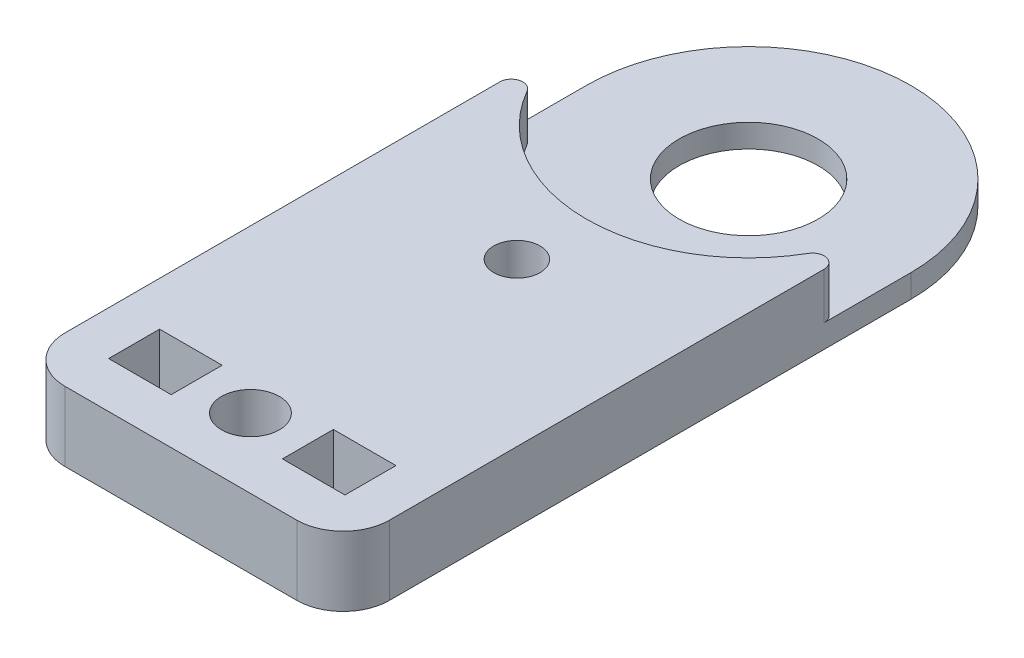
ISO-10303-21;
HEADER;
FILE_DESCRIPTION(('STEP AP214'),'2;1');
FILE_NAME('part.step','',(''),(''),'','','');
FILE_SCHEMA(('AUTOMOTIVE_DESIGN { 1 0 10303 214 1 1 1 1 }'));
ENDSEC;
DATA;
#1=APPLICATION_CONTEXT('core data for automotive mechanical design processes');
#2=APPLICATION_PROTOCOL_DEFINITION('international standard','automotive_design',2000,#1);
#3=PRODUCT_CONTEXT('',#1,'mechanical');
#4=PRODUCT('Part','Part','',(#3));
#5=PRODUCT_RELATED_PRODUCT_CATEGORY('part','',(#4));
#6=PRODUCT_DEFINITION_FORMATION('','',#4);
#7=PRODUCT_DEFINITION_CONTEXT('part definition',#1,'design');
#8=PRODUCT_DEFINITION('design','',#6,#7);
#9=PRODUCT_DEFINITION_SHAPE('','',#8);
#10=(LENGTH_UNIT() NAMED_UNIT(*) SI_UNIT(.MILLI.,.METRE.));
#11=(NAMED_UNIT(*) PLANE_ANGLE_UNIT() SI_UNIT($,.RADIAN.));
#12=(NAMED_UNIT(*) SI_UNIT($,.STERADIAN.) SOLID_ANGLE_UNIT());
#13=UNCERTAINTY_MEASURE_WITH_UNIT(LENGTH_MEASURE(1.E-05),#10,'distance_accuracy_value','');
#14=(GEOMETRIC_REPRESENTATION_CONTEXT(3) GLOBAL_UNCERTAINTY_ASSIGNED_CONTEXT((#13)) GLOBAL_UNIT_ASSIGNED_CONTEXT((#10,
#11,#12)) REPRESENTATION_CONTEXT('',''));
#15=CARTESIAN_POINT('',(0.,0.,0.));
#16=DIRECTION('',(0.,0.,1.));
#17=DIRECTION('',(1.,0.,0.));
#18=AXIS2_PLACEMENT_3D('',#15,#16,#17);
#19=CARTESIAN_POINT('',(0.,1.,-12.25));
#20=DIRECTION('',(0.,-1.,0.));
#21=DIRECTION('',(0.,0.,-1.));
#22=AXIS2_PLACEMENT_3D('',#19,#20,#21);
#23=CYLINDRICAL_SURFACE('',#22,7.);
#24=CARTESIAN_POINT('',(0.,1.,-12.25));
#25=DIRECTION('',(0.,1.,0.));
#26=DIRECTION('',(0.,0.,1.));
#27=AXIS2_PLACEMENT_3D('',#24,#25,#26);
#28=CIRCLE('',#27,7.);
#29=CARTESIAN_POINT('',(7.,1.,-12.25));
#30=VERTEX_POINT('',#29);
#31=CARTESIAN_POINT('',(-7.,1.,-12.25));
#32=VERTEX_POINT('',#31);
#33=EDGE_CURVE('E263',#30,#32,#28,.T.);
#34=ORIENTED_EDGE('',*,*,#33,.F.);
#35=DIRECTION('',(0.,-1.,0.));
#36=VECTOR('',#35,1.);
#37=CARTESIAN_POINT('',(7.,3.,-12.25));
#38=LINE('',#37,#36);
#39=CARTESIAN_POINT('',(7.,0.,-12.25));
#40=VERTEX_POINT('',#39);
#41=EDGE_CURVE('E252',#30,#40,#38,.T.);
#42=ORIENTED_EDGE('',*,*,#41,.T.);
#43=CARTESIAN_POINT('',(0.,0.,-12.25));
#44=DIRECTION('',(0.,1.,0.));
#45=DIRECTION('',(0.,0.,1.));
#46=AXIS2_PLACEMENT_3D('',#43,#44,#45);
#47=CIRCLE('',#46,7.);
#48=CARTESIAN_POINT('',(-7.,0.,-12.25));
#49=VERTEX_POINT('',#48);
#50=EDGE_CURVE('E262',#40,#49,#47,.T.);
#51=ORIENTED_EDGE('',*,*,#50,.T.);
#52=DIRECTION('',(0.,-1.,0.));
#53=VECTOR('',#52,1.);
#54=CARTESIAN_POINT('',(-7.,3.,-12.25));
#55=LINE('',#54,#53);
#56=EDGE_CURVE('E205',#32,#49,#55,.T.);
#57=ORIENTED_EDGE('',*,*,#56,.F.);
#58=EDGE_LOOP('',(#34,#42,#51,#57));
#59=FACE_BOUND('',#58,.T.);
#60=ADVANCED_FACE('F37',(#59),#23,.T.);
#61=CARTESIAN_POINT('',(0.,1.,-12.25));
#62=DIRECTION('',(0.,-1.,0.));
#63=DIRECTION('',(0.,0.,-1.));
#64=AXIS2_PLACEMENT_3D('',#61,#62,#63);
#65=CYLINDRICAL_SURFACE('',#64,3.);
#66=CARTESIAN_POINT('',(0.,1.,-12.25));
#67=DIRECTION('',(0.,1.,0.));
#68=DIRECTION('',(0.,0.,1.));
#69=AXIS2_PLACEMENT_3D('',#66,#67,#68);
#70=CIRCLE('',#69,3.);
#71=CARTESIAN_POINT('',(0.,1.,-9.25));
#72=VERTEX_POINT('',#71);
#73=EDGE_CURVE('E266',#72,#72,#70,.T.);
#74=ORIENTED_EDGE('',*,*,#73,.T.);
#75=EDGE_LOOP('',(#74));
#76=FACE_BOUND('',#75,.T.);
#77=CARTESIAN_POINT('',(0.,0.,-12.25));
#78=DIRECTION('',(0.,1.,0.));
#79=DIRECTION('',(0.,0.,1.));
#80=AXIS2_PLACEMENT_3D('',#77,#78,#79);
#81=CIRCLE('',#80,3.);
#82=CARTESIAN_POINT('',(0.,0.,-9.25));
#83=VERTEX_POINT('',#82);
#84=EDGE_CURVE('E267',#83,#83,#81,.T.);
#85=ORIENTED_EDGE('',*,*,#84,.F.);
#86=EDGE_LOOP('',(#85));
#87=FACE_BOUND('',#86,.T.);
#88=ADVANCED_FACE('F406',(#76,#87),#65,.F.);
#89=CARTESIAN_POINT('',(0.,1.,0.));
#90=DIRECTION('',(0.,1.,0.));
#91=DIRECTION('',(0.,0.,1.));
#92=AXIS2_PLACEMENT_3D('',#89,#90,#91);
#93=PLANE('',#92);
#94=ORIENTED_EDGE('',*,*,#33,.T.);
#95=DIRECTION('',(0.,0.,-1.));
#96=VECTOR('',#95,1.);
#97=CARTESIAN_POINT('',(-7.,1.,0.));
#98=LINE('',#97,#96);
#99=CARTESIAN_POINT('',(-7.,1.,-8.50834261322606));
#100=VERTEX_POINT('',#99);
#101=EDGE_CURVE('E290',#100,#32,#98,.T.);
#102=ORIENTED_EDGE('',*,*,#101,.F.);
#103=CARTESIAN_POINT('',(-6.5,1.,-8.50834261322606));
#104=DIRECTION('',(0.,1.,0.));
#105=DIRECTION('',(0.,0.,1.));
#106=AXIS2_PLACEMENT_3D('',#103,#104,#105);
#107=CIRCLE('',#106,0.5);
#108=CARTESIAN_POINT('',(-6.06666666666667,1.,-8.75778643901099));
#109=VERTEX_POINT('',#108);
#110=EDGE_CURVE('E297',#100,#109,#107,.F.);
#111=ORIENTED_EDGE('',*,*,#110,.T.);
#112=CARTESIAN_POINT('',(0.,1.,-12.25));
#113=DIRECTION('',(0.,1.,0.));
#114=DIRECTION('',(0.,0.,1.));
#115=AXIS2_PLACEMENT_3D('',#112,#113,#114);
#116=CIRCLE('',#115,7.);
#117=CARTESIAN_POINT('',(6.06666666666667,1.,-8.75778643901099));
#118=VERTEX_POINT('',#117);
#119=EDGE_CURVE('E248',#118,#109,#116,.F.);
#120=ORIENTED_EDGE('',*,*,#119,.F.);
#121=CARTESIAN_POINT('',(6.5,1.,-8.50834261322606));
#122=DIRECTION('',(0.,1.,0.));
#123=DIRECTION('',(0.,0.,1.));
#124=AXIS2_PLACEMENT_3D('',#121,#122,#123);
#125=CIRCLE('',#124,0.5);
#126=CARTESIAN_POINT('',(7.,1.,-8.50834261322606));
#127=VERTEX_POINT('',#126);
#128=EDGE_CURVE('E295',#118,#127,#125,.F.);
#129=ORIENTED_EDGE('',*,*,#128,.T.);
#130=DIRECTION('',(0.,0.,1.));
#131=VECTOR('',#130,1.);
#132=CARTESIAN_POINT('',(7.,1.,0.));
#133=LINE('',#132,#131);
#134=EDGE_CURVE('E282',#30,#127,#133,.T.);
#135=ORIENTED_EDGE('',*,*,#134,.F.);
#136=EDGE_LOOP('',(#94,#102,#111,#120,#129,#135));
#137=FACE_BOUND('',#136,.T.);
#138=ORIENTED_EDGE('',*,*,#73,.F.);
#139=EDGE_LOOP('',(#138));
#140=FACE_BOUND('',#139,.T.);
#141=ADVANCED_FACE('F341',(#137,#140),#93,.T.);
#142=CARTESIAN_POINT('',(0.,0.,0.));
#143=DIRECTION('',(0.,1.,0.));
#144=DIRECTION('',(0.,0.,1.));
#145=AXIS2_PLACEMENT_3D('',#142,#143,#144);
#146=PLANE('',#145);
#147=DIRECTION('',(0.,0.,-1.));
#148=VECTOR('',#147,1.);
#149=CARTESIAN_POINT('',(7.,0.,0.));
#150=LINE('',#149,#148);
#151=CARTESIAN_POINT('',(7.,0.,10.25));
#152=VERTEX_POINT('',#151);
#153=EDGE_CURVE('E212',#152,#40,#150,.T.);
#154=ORIENTED_EDGE('',*,*,#153,.F.);
#155=CARTESIAN_POINT('',(5.,0.,10.25));
#156=DIRECTION('',(0.,1.,0.));
#157=DIRECTION('',(0.,0.,1.));
#158=AXIS2_PLACEMENT_3D('',#155,#156,#157);
#159=CIRCLE('',#158,2.);
#160=CARTESIAN_POINT('',(5.,0.,12.25));
#161=VERTEX_POINT('',#160);
#162=EDGE_CURVE('E304',#152,#161,#159,.F.);
#163=ORIENTED_EDGE('',*,*,#162,.T.);
#164=DIRECTION('',(1.,0.,0.));
#165=VECTOR('',#164,1.);
#166=CARTESIAN_POINT('',(0.,0.,12.25));
#167=LINE('',#166,#165);
#168=CARTESIAN_POINT('',(-4.99999999999999,0.,12.25));
#169=VERTEX_POINT('',#168);
#170=EDGE_CURVE('E216',#169,#161,#167,.T.);
#171=ORIENTED_EDGE('',*,*,#170,.F.);
#172=CARTESIAN_POINT('',(-4.99999999999999,0.,10.25));
#173=DIRECTION('',(0.,1.,0.));
#174=DIRECTION('',(0.,0.,1.));
#175=AXIS2_PLACEMENT_3D('',#172,#173,#174);
#176=CIRCLE('',#175,2.);
#177=CARTESIAN_POINT('',(-6.99999999999999,0.,10.25));
#178=VERTEX_POINT('',#177);
#179=EDGE_CURVE('E302',#169,#178,#176,.F.);
#180=ORIENTED_EDGE('',*,*,#179,.T.);
#181=DIRECTION('',(0.,0.,-1.));
#182=VECTOR('',#181,1.);
#183=CARTESIAN_POINT('',(-7.,0.,0.));
#184=LINE('',#183,#182);
#185=EDGE_CURVE('E214',#178,#49,#184,.T.);
#186=ORIENTED_EDGE('',*,*,#185,.T.);
#187=ORIENTED_EDGE('',*,*,#50,.F.);
#188=EDGE_LOOP('',(#154,#163,#171,#180,#186,#187));
#189=FACE_BOUND('',#188,.T.);
#190=ORIENTED_EDGE('',*,*,#84,.T.);
#191=EDGE_LOOP('',(#190));
#192=FACE_BOUND('',#191,.T.);
#193=CARTESIAN_POINT('',(0.,0.,-2.25));
#194=DIRECTION('',(0.,1.,0.));
#195=DIRECTION('',(0.,0.,1.));
#196=AXIS2_PLACEMENT_3D('',#193,#194,#195);
#197=CIRCLE('',#196,1.);
#198=CARTESIAN_POINT('',(0.,0.,-1.25));
#199=VERTEX_POINT('',#198);
#200=EDGE_CURVE('E206',#199,#199,#197,.T.);
#201=ORIENTED_EDGE('',*,*,#200,.T.);
#202=EDGE_LOOP('',(#201));
#203=FACE_BOUND('',#202,.T.);
#204=CARTESIAN_POINT('',(0.,0.,9.25));
#205=DIRECTION('',(0.,1.,0.));
#206=DIRECTION('',(0.,0.,1.));
#207=AXIS2_PLACEMENT_3D('',#204,#205,#206);
#208=CIRCLE('',#207,1.25);
#209=CARTESIAN_POINT('',(0.,0.,10.5));
#210=VERTEX_POINT('',#209);
#211=EDGE_CURVE('E209',#210,#210,#208,.T.);
#212=ORIENTED_EDGE('',*,*,#211,.T.);
#213=EDGE_LOOP('',(#212));
#214=FACE_BOUND('',#213,.T.);
#215=DIRECTION('',(0.,0.,1.));
#216=VECTOR('',#215,1.);
#217=CARTESIAN_POINT('',(-5.1,0.,0.));
#218=LINE('',#217,#216);
#219=CARTESIAN_POINT('',(-5.1,0.,8.07071615635404));
#220=VERTEX_POINT('',#219);
#221=CARTESIAN_POINT('',(-5.1,0.,10.270716156354));
#222=VERTEX_POINT('',#221);
#223=EDGE_CURVE('E168',#220,#222,#218,.T.);
#224=ORIENTED_EDGE('',*,*,#223,.T.);
#225=DIRECTION('',(-1.,0.,0.));
#226=VECTOR('',#225,1.);
#227=CARTESIAN_POINT('',(0.,0.,10.270716156354));
#228=LINE('',#227,#226);
#229=CARTESIAN_POINT('',(-2.4,0.,10.270716156354));
#230=VERTEX_POINT('',#229);
#231=EDGE_CURVE('E224',#230,#222,#228,.T.);
#232=ORIENTED_EDGE('',*,*,#231,.F.);
#233=DIRECTION('',(0.,0.,1.));
#234=VECTOR('',#233,1.);
#235=CARTESIAN_POINT('',(-2.4,0.,0.));
#236=LINE('',#235,#234);
#237=CARTESIAN_POINT('',(-2.4,0.,8.07071615635404));
#238=VERTEX_POINT('',#237);
#239=EDGE_CURVE('E221',#238,#230,#236,.T.);
#240=ORIENTED_EDGE('',*,*,#239,.F.);
#241=DIRECTION('',(-1.,0.,0.));
#242=VECTOR('',#241,1.);
#243=CARTESIAN_POINT('',(0.,0.,8.07071615635404));
#244=LINE('',#243,#242);
#245=EDGE_CURVE('E219',#238,#220,#244,.T.);
#246=ORIENTED_EDGE('',*,*,#245,.T.);
#247=EDGE_LOOP('',(#224,#232,#240,#246));
#248=FACE_BOUND('',#247,.T.);
#249=DIRECTION('',(0.,0.,1.));
#250=VECTOR('',#249,1.);
#251=CARTESIAN_POINT('',(2.40000000000001,0.,0.));
#252=LINE('',#251,#250);
#253=CARTESIAN_POINT('',(2.40000000000001,0.,8.07071615635404));
#254=VERTEX_POINT('',#253);
#255=CARTESIAN_POINT('',(2.40000000000001,0.,10.270716156354));
#256=VERTEX_POINT('',#255);
#257=EDGE_CURVE('E227',#254,#256,#252,.T.);
#258=ORIENTED_EDGE('',*,*,#257,.T.);
#259=DIRECTION('',(1.,0.,0.));
#260=VECTOR('',#259,1.);
#261=CARTESIAN_POINT('',(0.,0.,10.270716156354));
#262=LINE('',#261,#260);
#263=CARTESIAN_POINT('',(5.10000000000001,0.,10.270716156354));
#264=VERTEX_POINT('',#263);
#265=EDGE_CURVE('E236',#256,#264,#262,.T.);
#266=ORIENTED_EDGE('',*,*,#265,.T.);
#267=DIRECTION('',(0.,0.,1.));
#268=VECTOR('',#267,1.);
#269=CARTESIAN_POINT('',(5.10000000000001,0.,0.));
#270=LINE('',#269,#268);
#271=CARTESIAN_POINT('',(5.10000000000001,0.,8.07071615635404));
#272=VERTEX_POINT('',#271);
#273=EDGE_CURVE('E233',#272,#264,#270,.T.);
#274=ORIENTED_EDGE('',*,*,#273,.F.);
#275=DIRECTION('',(1.,0.,0.));
#276=VECTOR('',#275,1.);
#277=CARTESIAN_POINT('',(0.,0.,8.07071615635404));
#278=LINE('',#277,#276);
#279=EDGE_CURVE('E230',#254,#272,#278,.T.);
#280=ORIENTED_EDGE('',*,*,#279,.F.);
#281=EDGE_LOOP('',(#258,#266,#274,#280));
#282=FACE_BOUND('',#281,.T.);
#283=ADVANCED_FACE('F328',(#189,#192,#203,#214,#248,#282),#146,.F.);
#284=CARTESIAN_POINT('',(2.40000000000001,3.,0.));
#285=DIRECTION('',(1.,0.,0.));
#286=DIRECTION('',(0.,0.,-1.));
#287=AXIS2_PLACEMENT_3D('',#284,#285,#286);
#288=PLANE('',#287);
#289=ORIENTED_EDGE('',*,*,#257,.F.);
#290=DIRECTION('',(0.,-1.,0.));
#291=VECTOR('',#290,1.);
#292=CARTESIAN_POINT('',(2.40000000000001,3.,8.07071615635404));
#293=LINE('',#292,#291);
#294=CARTESIAN_POINT('',(2.40000000000001,3.,8.07071615635404));
#295=VERTEX_POINT('',#294);
#296=EDGE_CURVE('E246',#295,#254,#293,.T.);
#297=ORIENTED_EDGE('',*,*,#296,.F.);
#298=DIRECTION('',(0.,0.,1.));
#299=VECTOR('',#298,1.);
#300=CARTESIAN_POINT('',(2.40000000000001,3.,0.));
#301=LINE('',#300,#299);
#302=CARTESIAN_POINT('',(2.40000000000001,3.,10.270716156354));
#303=VERTEX_POINT('',#302);
#304=EDGE_CURVE('E194',#295,#303,#301,.T.);
#305=ORIENTED_EDGE('',*,*,#304,.T.);
#306=DIRECTION('',(0.,-1.,0.));
#307=VECTOR('',#306,1.);
#308=CARTESIAN_POINT('',(2.40000000000001,3.,10.270716156354));
#309=LINE('',#308,#307);
#310=EDGE_CURVE('E173',#303,#256,#309,.T.);
#311=ORIENTED_EDGE('',*,*,#310,.T.);
#312=EDGE_LOOP('',(#289,#297,#305,#311));
#313=FACE_BOUND('',#312,.T.);
#314=ADVANCED_FACE('F380',(#313),#288,.T.);
#315=CARTESIAN_POINT('',(0.,3.,8.07071615635404));
#316=DIRECTION('',(0.,0.,-1.));
#317=DIRECTION('',(-1.,0.,0.));
#318=AXIS2_PLACEMENT_3D('',#315,#316,#317);
#319=PLANE('',#318);
#320=ORIENTED_EDGE('',*,*,#279,.T.);
#321=DIRECTION('',(0.,-1.,0.));
#322=VECTOR('',#321,1.);
#323=CARTESIAN_POINT('',(5.10000000000001,3.,8.07071615635404));
#324=LINE('',#323,#322);
#325=CARTESIAN_POINT('',(5.10000000000001,3.,8.07071615635404));
#326=VERTEX_POINT('',#325);
#327=EDGE_CURVE('E243',#326,#272,#324,.T.);
#328=ORIENTED_EDGE('',*,*,#327,.F.);
#329=DIRECTION('',(1.,0.,0.));
#330=VECTOR('',#329,1.);
#331=CARTESIAN_POINT('',(0.,3.,8.07071615635404));
#332=LINE('',#331,#330);
#333=EDGE_CURVE('E197',#295,#326,#332,.T.);
#334=ORIENTED_EDGE('',*,*,#333,.F.);
#335=ORIENTED_EDGE('',*,*,#296,.T.);
#336=EDGE_LOOP('',(#320,#328,#334,#335));
#337=FACE_BOUND('',#336,.T.);
#338=ADVANCED_FACE('F395',(#337),#319,.F.);
#339=CARTESIAN_POINT('',(5.10000000000001,3.,0.));
#340=DIRECTION('',(1.,0.,0.));
#341=DIRECTION('',(0.,0.,-1.));
#342=AXIS2_PLACEMENT_3D('',#339,#340,#341);
#343=PLANE('',#342);
#344=ORIENTED_EDGE('',*,*,#273,.T.);
#345=DIRECTION('',(0.,-1.,0.));
#346=VECTOR('',#345,1.);
#347=CARTESIAN_POINT('',(5.10000000000001,3.,10.270716156354));
#348=LINE('',#347,#346);
#349=CARTESIAN_POINT('',(5.10000000000001,3.,10.270716156354));
#350=VERTEX_POINT('',#349);
#351=EDGE_CURVE('E241',#350,#264,#348,.T.);
#352=ORIENTED_EDGE('',*,*,#351,.F.);
#353=DIRECTION('',(0.,0.,1.));
#354=VECTOR('',#353,1.);
#355=CARTESIAN_POINT('',(5.10000000000001,3.,0.));
#356=LINE('',#355,#354);
#357=EDGE_CURVE('E200',#326,#350,#356,.T.);
#358=ORIENTED_EDGE('',*,*,#357,.F.);
#359=ORIENTED_EDGE('',*,*,#327,.T.);
#360=EDGE_LOOP('',(#344,#352,#358,#359));
#361=FACE_BOUND('',#360,.T.);
#362=ADVANCED_FACE('F391',(#361),#343,.F.);
#363=CARTESIAN_POINT('',(-5.1,3.,0.));
#364=DIRECTION('',(1.,0.,0.));
#365=DIRECTION('',(0.,0.,-1.));
#366=AXIS2_PLACEMENT_3D('',#363,#364,#365);
#367=PLANE('',#366);
#368=ORIENTED_EDGE('',*,*,#223,.F.);
#369=DIRECTION('',(0.,-1.,0.));
#370=VECTOR('',#369,1.);
#371=CARTESIAN_POINT('',(-5.1,3.,8.07071615635404));
#372=LINE('',#371,#370);
#373=CARTESIAN_POINT('',(-5.1,3.,8.07071615635404));
#374=VERTEX_POINT('',#373);
#375=EDGE_CURVE('E163',#374,#220,#372,.T.);
#376=ORIENTED_EDGE('',*,*,#375,.F.);
#377=DIRECTION('',(0.,0.,1.));
#378=VECTOR('',#377,1.);
#379=CARTESIAN_POINT('',(-5.1,3.,0.));
#380=LINE('',#379,#378);
#381=CARTESIAN_POINT('',(-5.1,3.,10.270716156354));
#382=VERTEX_POINT('',#381);
#383=EDGE_CURVE('E166',#374,#382,#380,.T.);
#384=ORIENTED_EDGE('',*,*,#383,.T.);
#385=DIRECTION('',(0.,-1.,0.));
#386=VECTOR('',#385,1.);
#387=CARTESIAN_POINT('',(-5.1,3.,10.270716156354));
#388=LINE('',#387,#386);
#389=EDGE_CURVE('E249',#382,#222,#388,.T.);
#390=ORIENTED_EDGE('',*,*,#389,.T.);
#391=EDGE_LOOP('',(#368,#376,#384,#390));
#392=FACE_BOUND('',#391,.T.);
#393=ADVANCED_FACE('F165',(#392),#367,.T.);
#394=CARTESIAN_POINT('',(0.,3.,8.07071615635404));
#395=DIRECTION('',(0.,0.,1.));
#396=DIRECTION('',(1.,0.,0.));
#397=AXIS2_PLACEMENT_3D('',#394,#395,#396);
#398=PLANE('',#397);
#399=ORIENTED_EDGE('',*,*,#245,.F.);
#400=DIRECTION('',(0.,-1.,0.));
#401=VECTOR('',#400,1.);
#402=CARTESIAN_POINT('',(-2.4,3.,8.07071615635404));
#403=LINE('',#402,#401);
#404=CARTESIAN_POINT('',(-2.4,3.,8.07071615635404));
#405=VERTEX_POINT('',#404);
#406=EDGE_CURVE('E174',#405,#238,#403,.T.);
#407=ORIENTED_EDGE('',*,*,#406,.F.);
#408=DIRECTION('',(-1.,0.,0.));
#409=VECTOR('',#408,1.);
#410=CARTESIAN_POINT('',(0.,3.,8.07071615635404));
#411=LINE('',#410,#409);
#412=EDGE_CURVE('E181',#405,#374,#411,.T.);
#413=ORIENTED_EDGE('',*,*,#412,.T.);
#414=ORIENTED_EDGE('',*,*,#375,.T.);
#415=EDGE_LOOP('',(#399,#407,#413,#414));
#416=FACE_BOUND('',#415,.T.);
#417=ADVANCED_FACE('F186',(#416),#398,.T.);
#418=CARTESIAN_POINT('',(-2.4,3.,0.));
#419=DIRECTION('',(1.,0.,0.));
#420=DIRECTION('',(0.,0.,-1.));
#421=AXIS2_PLACEMENT_3D('',#418,#419,#420);
#422=PLANE('',#421);
#423=ORIENTED_EDGE('',*,*,#239,.T.);
#424=DIRECTION('',(0.,-1.,0.));
#425=VECTOR('',#424,1.);
#426=CARTESIAN_POINT('',(-2.4,3.,10.270716156354));
#427=LINE('',#426,#425);
#428=CARTESIAN_POINT('',(-2.4,3.,10.270716156354));
#429=VERTEX_POINT('',#428);
#430=EDGE_CURVE('E251',#429,#230,#427,.T.);
#431=ORIENTED_EDGE('',*,*,#430,.F.);
#432=DIRECTION('',(0.,0.,1.));
#433=VECTOR('',#432,1.);
#434=CARTESIAN_POINT('',(-2.4,3.,0.));
#435=LINE('',#434,#433);
#436=EDGE_CURVE('E188',#405,#429,#435,.T.);
#437=ORIENTED_EDGE('',*,*,#436,.F.);
#438=ORIENTED_EDGE('',*,*,#406,.T.);
#439=EDGE_LOOP('',(#423,#431,#437,#438));
#440=FACE_BOUND('',#439,.T.);
#441=ADVANCED_FACE('F457',(#440),#422,.F.);
#442=CARTESIAN_POINT('',(7.,3.,0.));
#443=DIRECTION('',(-1.,0.,0.));
#444=DIRECTION('',(0.,0.,1.));
#445=AXIS2_PLACEMENT_3D('',#442,#443,#444);
#446=PLANE('',#445);
#447=DIRECTION('',(0.,0.,-1.));
#448=VECTOR('',#447,1.);
#449=CARTESIAN_POINT('',(7.,3.,0.));
#450=LINE('',#449,#448);
#451=CARTESIAN_POINT('',(7.,3.,10.25));
#452=VERTEX_POINT('',#451);
#453=CARTESIAN_POINT('',(7.,3.,-8.50834261322606));
#454=VERTEX_POINT('',#453);
#455=EDGE_CURVE('E314',#452,#454,#450,.T.);
#456=ORIENTED_EDGE('',*,*,#455,.F.);
#457=DIRECTION('',(0.,-1.,0.));
#458=VECTOR('',#457,1.);
#459=CARTESIAN_POINT('',(7.,3.,10.25));
#460=LINE('',#459,#458);
#461=EDGE_CURVE('E299',#452,#152,#460,.T.);
#462=ORIENTED_EDGE('',*,*,#461,.T.);
#463=ORIENTED_EDGE('',*,*,#153,.T.);
#464=ORIENTED_EDGE('',*,*,#41,.F.);
#465=ORIENTED_EDGE('',*,*,#134,.T.);
#466=DIRECTION('',(0.,1.,0.));
#467=VECTOR('',#466,1.);
#468=CARTESIAN_POINT('',(7.,3.,-8.50834261322606));
#469=LINE('',#468,#467);
#470=EDGE_CURVE('E279',#127,#454,#469,.T.);
#471=ORIENTED_EDGE('',*,*,#470,.T.);
#472=EDGE_LOOP('',(#456,#462,#463,#464,#465,#471));
#473=FACE_BOUND('',#472,.T.);
#474=ADVANCED_FACE('F318',(#473),#446,.F.);
#475=CARTESIAN_POINT('',(0.,3.,-12.25));
#476=DIRECTION('',(0.,-1.,0.));
#477=DIRECTION('',(0.,0.,-1.));
#478=AXIS2_PLACEMENT_3D('',#475,#476,#477);
#479=CYLINDRICAL_SURFACE('',#478,7.);
#480=CARTESIAN_POINT('',(0.,3.,-12.25));
#481=DIRECTION('',(0.,1.,0.));
#482=DIRECTION('',(0.,0.,1.));
#483=AXIS2_PLACEMENT_3D('',#480,#481,#482);
#484=CIRCLE('',#483,7.);
#485=CARTESIAN_POINT('',(-6.06666666666667,3.,-8.75778643901099));
#486=VERTEX_POINT('',#485);
#487=CARTESIAN_POINT('',(6.06666666666667,3.,-8.75778643901099));
#488=VERTEX_POINT('',#487);
#489=EDGE_CURVE('E322',#486,#488,#484,.T.);
#490=ORIENTED_EDGE('',*,*,#489,.T.);
#491=DIRECTION('',(0.,-1.,0.));
#492=VECTOR('',#491,1.);
#493=CARTESIAN_POINT('',(6.06666666666667,3.,-8.75778643901099));
#494=LINE('',#493,#492);
#495=EDGE_CURVE('E276',#488,#118,#494,.T.);
#496=ORIENTED_EDGE('',*,*,#495,.T.);
#497=ORIENTED_EDGE('',*,*,#119,.T.);
#498=DIRECTION('',(0.,-1.,0.));
#499=VECTOR('',#498,1.);
#500=CARTESIAN_POINT('',(-6.06666666666667,3.,-8.75778643901099));
#501=LINE('',#500,#499);
#502=EDGE_CURVE('E270',#109,#486,#501,.F.);
#503=ORIENTED_EDGE('',*,*,#502,.T.);
#504=EDGE_LOOP('',(#490,#496,#497,#503));
#505=FACE_BOUND('',#504,.T.);
#506=ADVANCED_FACE('F352',(#505),#479,.F.);
#507=CARTESIAN_POINT('',(-7.,3.,0.));
#508=DIRECTION('',(-1.,0.,0.));
#509=DIRECTION('',(0.,0.,1.));
#510=AXIS2_PLACEMENT_3D('',#507,#508,#509);
#511=PLANE('',#510);
#512=ORIENTED_EDGE('',*,*,#185,.F.);
#513=DIRECTION('',(0.,-1.,0.));
#514=VECTOR('',#513,1.);
#515=CARTESIAN_POINT('',(-6.99999999999999,3.,10.25));
#516=LINE('',#515,#514);
#517=CARTESIAN_POINT('',(-6.99999999999999,3.,10.25));
#518=VERTEX_POINT('',#517);
#519=EDGE_CURVE('E11',#178,#518,#516,.F.);
#520=ORIENTED_EDGE('',*,*,#519,.T.);
#521=DIRECTION('',(0.,0.,-1.));
#522=VECTOR('',#521,1.);
#523=CARTESIAN_POINT('',(-7.,3.,0.));
#524=LINE('',#523,#522);
#525=CARTESIAN_POINT('',(-7.,3.,-8.50834261322606));
#526=VERTEX_POINT('',#525);
#527=EDGE_CURVE('E354',#518,#526,#524,.T.);
#528=ORIENTED_EDGE('',*,*,#527,.T.);
#529=DIRECTION('',(0.,-1.,0.));
#530=VECTOR('',#529,1.);
#531=CARTESIAN_POINT('',(-7.,3.,-8.50834261322606));
#532=LINE('',#531,#530);
#533=EDGE_CURVE('E292',#526,#100,#532,.T.);
#534=ORIENTED_EDGE('',*,*,#533,.T.);
#535=ORIENTED_EDGE('',*,*,#101,.T.);
#536=ORIENTED_EDGE('',*,*,#56,.T.);
#537=EDGE_LOOP('',(#512,#520,#528,#534,#535,#536));
#538=FACE_BOUND('',#537,.T.);
#539=ADVANCED_FACE('F335',(#538),#511,.T.);
#540=CARTESIAN_POINT('',(0.,3.,10.270716156354));
#541=DIRECTION('',(0.,0.,1.));
#542=DIRECTION('',(1.,0.,0.));
#543=AXIS2_PLACEMENT_3D('',#540,#541,#542);
#544=PLANE('',#543);
#545=ORIENTED_EDGE('',*,*,#231,.T.);
#546=ORIENTED_EDGE('',*,*,#389,.F.);
#547=DIRECTION('',(-1.,0.,0.));
#548=VECTOR('',#547,1.);
#549=CARTESIAN_POINT('',(0.,3.,10.270716156354));
#550=LINE('',#549,#548);
#551=EDGE_CURVE('E182',#429,#382,#550,.T.);
#552=ORIENTED_EDGE('',*,*,#551,.F.);
#553=ORIENTED_EDGE('',*,*,#430,.T.);
#554=EDGE_LOOP('',(#545,#546,#552,#553));
#555=FACE_BOUND('',#554,.T.);
#556=ADVANCED_FACE('F443',(#555),#544,.F.);
#557=CARTESIAN_POINT('',(0.,3.,12.25));
#558=DIRECTION('',(0.,0.,-1.));
#559=DIRECTION('',(-1.,0.,0.));
#560=AXIS2_PLACEMENT_3D('',#557,#558,#559);
#561=PLANE('',#560);
#562=ORIENTED_EDGE('',*,*,#170,.T.);
#563=DIRECTION('',(0.,-1.,0.));
#564=VECTOR('',#563,1.);
#565=CARTESIAN_POINT('',(5.,3.,12.25));
#566=LINE('',#565,#564);
#567=CARTESIAN_POINT('',(5.,3.,12.25));
#568=VERTEX_POINT('',#567);
#569=EDGE_CURVE('E58',#161,#568,#566,.F.);
#570=ORIENTED_EDGE('',*,*,#569,.T.);
#571=DIRECTION('',(1.,0.,0.));
#572=VECTOR('',#571,1.);
#573=CARTESIAN_POINT('',(0.,3.,12.25));
#574=LINE('',#573,#572);
#575=CARTESIAN_POINT('',(-4.99999999999999,3.,12.25));
#576=VERTEX_POINT('',#575);
#577=EDGE_CURVE('E184',#576,#568,#574,.T.);
#578=ORIENTED_EDGE('',*,*,#577,.F.);
#579=DIRECTION('',(0.,-1.,0.));
#580=VECTOR('',#579,1.);
#581=CARTESIAN_POINT('',(-4.99999999999999,0.,12.25));
#582=LINE('',#581,#580);
#583=EDGE_CURVE('E306',#576,#169,#582,.T.);
#584=ORIENTED_EDGE('',*,*,#583,.T.);
#585=EDGE_LOOP('',(#562,#570,#578,#584));
#586=FACE_BOUND('',#585,.T.);
#587=ADVANCED_FACE('F331',(#586),#561,.F.);
#588=CARTESIAN_POINT('',(0.,3.,9.25));
#589=DIRECTION('',(0.,-1.,0.));
#590=DIRECTION('',(0.,0.,-1.));
#591=AXIS2_PLACEMENT_3D('',#588,#589,#590);
#592=CYLINDRICAL_SURFACE('',#591,1.25);
#593=CARTESIAN_POINT('',(0.,3.,9.25));
#594=DIRECTION('',(0.,1.,0.));
#595=DIRECTION('',(0.,0.,1.));
#596=AXIS2_PLACEMENT_3D('',#593,#594,#595);
#597=CIRCLE('',#596,1.25);
#598=CARTESIAN_POINT('',(0.,3.,10.5));
#599=VERTEX_POINT('',#598);
#600=EDGE_CURVE('E323',#599,#599,#597,.T.);
#601=ORIENTED_EDGE('',*,*,#600,.T.);
#602=EDGE_LOOP('',(#601));
#603=FACE_BOUND('',#602,.T.);
#604=ORIENTED_EDGE('',*,*,#211,.F.);
#605=EDGE_LOOP('',(#604));
#606=FACE_BOUND('',#605,.T.);
#607=ADVANCED_FACE('F372',(#603,#606),#592,.F.);
#608=CARTESIAN_POINT('',(0.,3.,-2.25));
#609=DIRECTION('',(0.,-1.,0.));
#610=DIRECTION('',(0.,0.,-1.));
#611=AXIS2_PLACEMENT_3D('',#608,#609,#610);
#612=CYLINDRICAL_SURFACE('',#611,1.);
#613=CARTESIAN_POINT('',(0.,3.,-2.25));
#614=DIRECTION('',(0.,1.,0.));
#615=DIRECTION('',(0.,0.,1.));
#616=AXIS2_PLACEMENT_3D('',#613,#614,#615);
#617=CIRCLE('',#616,1.);
#618=CARTESIAN_POINT('',(0.,3.,-1.25));
#619=VERTEX_POINT('',#618);
#620=EDGE_CURVE('E239',#619,#619,#617,.T.);
#621=ORIENTED_EDGE('',*,*,#620,.T.);
#622=EDGE_LOOP('',(#621));
#623=FACE_BOUND('',#622,.T.);
#624=ORIENTED_EDGE('',*,*,#200,.F.);
#625=EDGE_LOOP('',(#624));
#626=FACE_BOUND('',#625,.T.);
#627=ADVANCED_FACE('F363',(#623,#626),#612,.F.);
#628=CARTESIAN_POINT('',(0.,3.,10.270716156354));
#629=DIRECTION('',(0.,0.,-1.));
#630=DIRECTION('',(-1.,0.,0.));
#631=AXIS2_PLACEMENT_3D('',#628,#629,#630);
#632=PLANE('',#631);
#633=ORIENTED_EDGE('',*,*,#265,.F.);
#634=ORIENTED_EDGE('',*,*,#310,.F.);
#635=DIRECTION('',(1.,0.,0.));
#636=VECTOR('',#635,1.);
#637=CARTESIAN_POINT('',(0.,3.,10.270716156354));
#638=LINE('',#637,#636);
#639=EDGE_CURVE('E202',#303,#350,#638,.T.);
#640=ORIENTED_EDGE('',*,*,#639,.T.);
#641=ORIENTED_EDGE('',*,*,#351,.T.);
#642=EDGE_LOOP('',(#633,#634,#640,#641));
#643=FACE_BOUND('',#642,.T.);
#644=ADVANCED_FACE('F368',(#643),#632,.T.);
#645=CARTESIAN_POINT('',(0.,3.,0.));
#646=DIRECTION('',(0.,1.,0.));
#647=DIRECTION('',(0.,0.,1.));
#648=AXIS2_PLACEMENT_3D('',#645,#646,#647);
#649=PLANE('',#648);
#650=ORIENTED_EDGE('',*,*,#620,.F.);
#651=EDGE_LOOP('',(#650));
#652=FACE_BOUND('',#651,.T.);
#653=ORIENTED_EDGE('',*,*,#600,.F.);
#654=EDGE_LOOP('',(#653));
#655=FACE_BOUND('',#654,.T.);
#656=ORIENTED_EDGE('',*,*,#577,.T.);
#657=CARTESIAN_POINT('',(5.,3.,10.25));
#658=DIRECTION('',(0.,1.,0.));
#659=DIRECTION('',(0.,0.,1.));
#660=AXIS2_PLACEMENT_3D('',#657,#658,#659);
#661=CIRCLE('',#660,2.);
#662=EDGE_CURVE('E45',#568,#452,#661,.T.);
#663=ORIENTED_EDGE('',*,*,#662,.T.);
#664=ORIENTED_EDGE('',*,*,#455,.T.);
#665=CARTESIAN_POINT('',(6.5,3.,-8.50834261322606));
#666=DIRECTION('',(0.,1.,0.));
#667=DIRECTION('',(0.,0.,1.));
#668=AXIS2_PLACEMENT_3D('',#665,#666,#667);
#669=CIRCLE('',#668,0.5);
#670=EDGE_CURVE('E288',#454,#488,#669,.T.);
#671=ORIENTED_EDGE('',*,*,#670,.T.);
#672=ORIENTED_EDGE('',*,*,#489,.F.);
#673=CARTESIAN_POINT('',(-6.5,3.,-8.50834261322606));
#674=DIRECTION('',(0.,1.,0.));
#675=DIRECTION('',(0.,0.,1.));
#676=AXIS2_PLACEMENT_3D('',#673,#674,#675);
#677=CIRCLE('',#676,0.5);
#678=EDGE_CURVE('E285',#486,#526,#677,.T.);
#679=ORIENTED_EDGE('',*,*,#678,.T.);
#680=ORIENTED_EDGE('',*,*,#527,.F.);
#681=CARTESIAN_POINT('',(-4.99999999999999,3.,10.25));
#682=DIRECTION('',(0.,1.,0.));
#683=DIRECTION('',(0.,0.,1.));
#684=AXIS2_PLACEMENT_3D('',#681,#682,#683);
#685=CIRCLE('',#684,2.);
#686=EDGE_CURVE('E310',#518,#576,#685,.T.);
#687=ORIENTED_EDGE('',*,*,#686,.T.);
#688=EDGE_LOOP('',(#656,#663,#664,#671,#672,#679,#680,#687));
#689=FACE_BOUND('',#688,.T.);
#690=ORIENTED_EDGE('',*,*,#383,.F.);
#691=ORIENTED_EDGE('',*,*,#412,.F.);
#692=ORIENTED_EDGE('',*,*,#436,.T.);
#693=ORIENTED_EDGE('',*,*,#551,.T.);
#694=EDGE_LOOP('',(#690,#691,#692,#693));
#695=FACE_BOUND('',#694,.T.);
#696=ORIENTED_EDGE('',*,*,#304,.F.);
#697=ORIENTED_EDGE('',*,*,#333,.T.);
#698=ORIENTED_EDGE('',*,*,#357,.T.);
#699=ORIENTED_EDGE('',*,*,#639,.F.);
#700=EDGE_LOOP('',(#696,#697,#698,#699));
#701=FACE_BOUND('',#700,.T.);
#702=ADVANCED_FACE('F178',(#652,#655,#689,#695,#701),#649,.T.);
#703=CARTESIAN_POINT('',(6.5,3.,-8.50834261322606));
#704=DIRECTION('',(0.,-1.,0.));
#705=DIRECTION('',(0.,0.,-1.));
#706=AXIS2_PLACEMENT_3D('',#703,#704,#705);
#707=CYLINDRICAL_SURFACE('',#706,0.5);
#708=ORIENTED_EDGE('',*,*,#670,.F.);
#709=ORIENTED_EDGE('',*,*,#470,.F.);
#710=ORIENTED_EDGE('',*,*,#128,.F.);
#711=ORIENTED_EDGE('',*,*,#495,.F.);
#712=EDGE_LOOP('',(#708,#709,#710,#711));
#713=FACE_BOUND('',#712,.T.);
#714=ADVANCED_FACE('F346',(#713),#707,.T.);
#715=CARTESIAN_POINT('',(-6.5,3.,-8.50834261322606));
#716=DIRECTION('',(0.,-1.,0.));
#717=DIRECTION('',(0.,0.,-1.));
#718=AXIS2_PLACEMENT_3D('',#715,#716,#717);
#719=CYLINDRICAL_SURFACE('',#718,0.5);
#720=ORIENTED_EDGE('',*,*,#678,.F.);
#721=ORIENTED_EDGE('',*,*,#502,.F.);
#722=ORIENTED_EDGE('',*,*,#110,.F.);
#723=ORIENTED_EDGE('',*,*,#533,.F.);
#724=EDGE_LOOP('',(#720,#721,#722,#723));
#725=FACE_BOUND('',#724,.T.);
#726=ADVANCED_FACE('F416',(#725),#719,.T.);
#727=CARTESIAN_POINT('',(5.,3.,10.25));
#728=DIRECTION('',(0.,-1.,0.));
#729=DIRECTION('',(0.,0.,-1.));
#730=AXIS2_PLACEMENT_3D('',#727,#728,#729);
#731=CYLINDRICAL_SURFACE('',#730,2.);
#732=ORIENTED_EDGE('',*,*,#662,.F.);
#733=ORIENTED_EDGE('',*,*,#569,.F.);
#734=ORIENTED_EDGE('',*,*,#162,.F.);
#735=ORIENTED_EDGE('',*,*,#461,.F.);
#736=EDGE_LOOP('',(#732,#733,#734,#735));
#737=FACE_BOUND('',#736,.T.);
#738=ADVANCED_FACE('F325',(#737),#731,.T.);
#739=CARTESIAN_POINT('',(-4.99999999999999,3.,10.25));
#740=DIRECTION('',(0.,1.,0.));
#741=DIRECTION('',(0.,0.,1.));
#742=AXIS2_PLACEMENT_3D('',#739,#740,#741);
#743=CYLINDRICAL_SURFACE('',#742,2.);
#744=ORIENTED_EDGE('',*,*,#686,.F.);
#745=ORIENTED_EDGE('',*,*,#519,.F.);
#746=ORIENTED_EDGE('',*,*,#179,.F.);
#747=ORIENTED_EDGE('',*,*,#583,.F.);
#748=EDGE_LOOP('',(#744,#745,#746,#747));
#749=FACE_BOUND('',#748,.T.);
#750=ADVANCED_FACE('F39',(#749),#743,.T.);
#751=CLOSED_SHELL('',(#60,#88,#141,#283,#314,#338,#362,#393,#417,#441,#474,#506,#539,#556,#587,
#607,#627,#644,#702,#714,#726,#738,#750));
#752=MANIFOLD_SOLID_BREP('B2',#751);
#753=ADVANCED_BREP_SHAPE_REPRESENTATION('',(#18,#752),#14);
#754=SHAPE_DEFINITION_REPRESENTATION(#9,#753);
ENDSEC;
END-ISO-10303-21;
